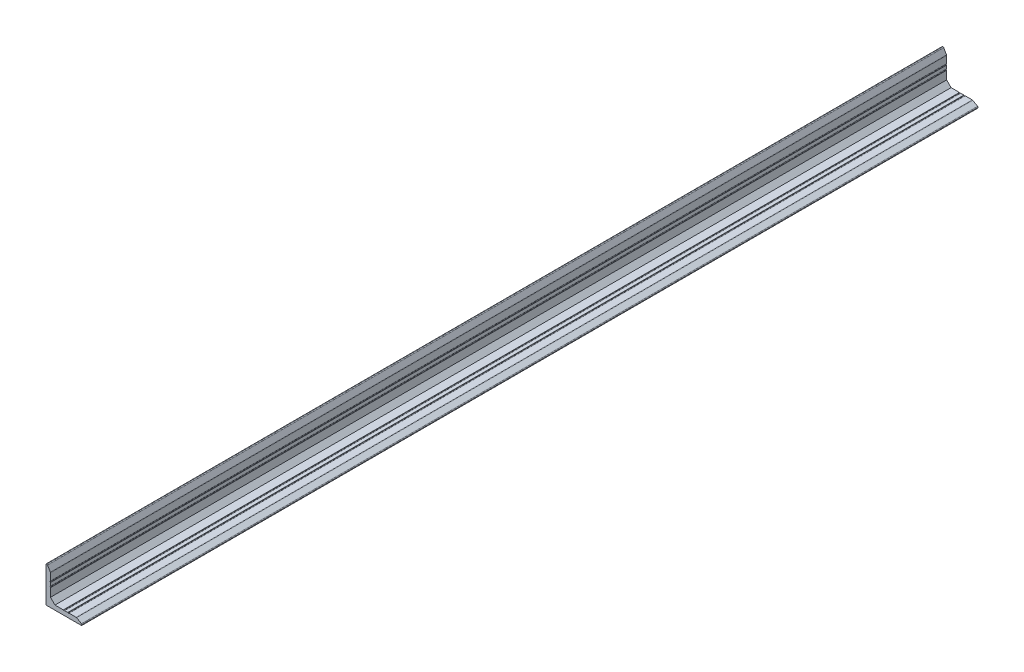
ISO-10303-21;
HEADER;
FILE_DESCRIPTION(('STEP AP214'),'2;1');
FILE_NAME('part.step','',(''),(''),'','','');
FILE_SCHEMA(('AUTOMOTIVE_DESIGN { 1 0 10303 214 1 1 1 1 }'));
ENDSEC;
DATA;
#1=APPLICATION_CONTEXT('core data for automotive mechanical design processes');
#2=APPLICATION_PROTOCOL_DEFINITION('international standard','automotive_design',2000,#1);
#3=PRODUCT_CONTEXT('',#1,'mechanical');
#4=PRODUCT('Part','Part','',(#3));
#5=PRODUCT_RELATED_PRODUCT_CATEGORY('part','',(#4));
#6=PRODUCT_DEFINITION_FORMATION('','',#4);
#7=PRODUCT_DEFINITION_CONTEXT('part definition',#1,'design');
#8=PRODUCT_DEFINITION('design','',#6,#7);
#9=PRODUCT_DEFINITION_SHAPE('','',#8);
#10=(LENGTH_UNIT() NAMED_UNIT(*) SI_UNIT(.MILLI.,.METRE.));
#11=(NAMED_UNIT(*) PLANE_ANGLE_UNIT() SI_UNIT($,.RADIAN.));
#12=(NAMED_UNIT(*) SI_UNIT($,.STERADIAN.) SOLID_ANGLE_UNIT());
#13=UNCERTAINTY_MEASURE_WITH_UNIT(LENGTH_MEASURE(1.E-05),#10,'distance_accuracy_value','');
#14=(GEOMETRIC_REPRESENTATION_CONTEXT(3) GLOBAL_UNCERTAINTY_ASSIGNED_CONTEXT((#13)) GLOBAL_UNIT_ASSIGNED_CONTEXT((#10,
#11,#12)) REPRESENTATION_CONTEXT('',''));
#15=CARTESIAN_POINT('',(0.,0.,0.));
#16=DIRECTION('',(0.,0.,1.));
#17=DIRECTION('',(1.,0.,0.));
#18=AXIS2_PLACEMENT_3D('',#15,#16,#17);
#19=CARTESIAN_POINT('',(40.,5.00000000000001,1000.));
#20=DIRECTION('',(0.,-1.,0.));
#21=DIRECTION('',(1.,0.,0.));
#22=AXIS2_PLACEMENT_3D('',#19,#20,#21);
#23=PLANE('',#22);
#24=DIRECTION('',(-1.,0.,0.));
#25=VECTOR('',#24,1.);
#26=CARTESIAN_POINT('',(40.,5.00000000000001,0.));
#27=LINE('',#26,#25);
#28=CARTESIAN_POINT('',(33.6698729810774,5.00000000000001,0.));
#29=VERTEX_POINT('',#28);
#30=CARTESIAN_POINT('',(25.7416198487096,5.00000000000001,0.));
#31=VERTEX_POINT('',#30);
#32=EDGE_CURVE('E453',#29,#31,#27,.T.);
#33=ORIENTED_EDGE('',*,*,#32,.T.);
#34=DIRECTION('',(0.,0.,1.));
#35=VECTOR('',#34,1.);
#36=CARTESIAN_POINT('',(25.7416198487096,5.00000000000001,1000.));
#37=LINE('',#36,#35);
#38=CARTESIAN_POINT('',(25.7416198487096,5.00000000000001,1000.));
#39=VERTEX_POINT('',#38);
#40=EDGE_CURVE('E10',#31,#39,#37,.T.);
#41=ORIENTED_EDGE('',*,*,#40,.T.);
#42=DIRECTION('',(-1.,0.,0.));
#43=VECTOR('',#42,1.);
#44=CARTESIAN_POINT('',(40.,5.00000000000001,1000.));
#45=LINE('',#44,#43);
#46=CARTESIAN_POINT('',(33.6698729810774,5.00000000000001,1000.));
#47=VERTEX_POINT('',#46);
#48=EDGE_CURVE('E260',#47,#39,#45,.T.);
#49=ORIENTED_EDGE('',*,*,#48,.F.);
#50=DIRECTION('',(0.,0.,1.));
#51=VECTOR('',#50,1.);
#52=CARTESIAN_POINT('',(33.6698729810774,5.00000000000001,0.));
#53=LINE('',#52,#51);
#54=EDGE_CURVE('E333',#47,#29,#53,.F.);
#55=ORIENTED_EDGE('',*,*,#54,.T.);
#56=EDGE_LOOP('',(#33,#41,#49,#55));
#57=FACE_BOUND('',#56,.T.);
#58=ADVANCED_FACE('F16',(#57),#23,.F.);
#59=CARTESIAN_POINT('',(24.2583801512904,5.00000000000001,0.));
#60=VERTEX_POINT('',#59);
#61=CARTESIAN_POINT('',(20.7416198487095,5.,0.));
#62=VERTEX_POINT('',#61);
#63=EDGE_CURVE('E457',#60,#62,#27,.T.);
#64=ORIENTED_EDGE('',*,*,#63,.T.);
#65=DIRECTION('',(0.,0.,1.));
#66=VECTOR('',#65,1.);
#67=CARTESIAN_POINT('',(20.7416198487095,5.,1000.));
#68=LINE('',#67,#66);
#69=CARTESIAN_POINT('',(20.7416198487095,5.,1000.));
#70=VERTEX_POINT('',#69);
#71=EDGE_CURVE('E401',#62,#70,#68,.T.);
#72=ORIENTED_EDGE('',*,*,#71,.T.);
#73=CARTESIAN_POINT('',(24.2583801512904,5.00000000000001,1000.));
#74=VERTEX_POINT('',#73);
#75=EDGE_CURVE('E258',#74,#70,#45,.T.);
#76=ORIENTED_EDGE('',*,*,#75,.F.);
#77=DIRECTION('',(0.,0.,1.));
#78=VECTOR('',#77,1.);
#79=CARTESIAN_POINT('',(24.2583801512904,5.00000000000001,1000.));
#80=LINE('',#79,#78);
#81=EDGE_CURVE('E38',#74,#60,#80,.F.);
#82=ORIENTED_EDGE('',*,*,#81,.T.);
#83=EDGE_LOOP('',(#64,#72,#76,#82));
#84=FACE_BOUND('',#83,.T.);
#85=ADVANCED_FACE('F488',(#84),#23,.F.);
#86=CARTESIAN_POINT('',(5.,5.,1000.));
#87=DIRECTION('',(-1.,0.,0.));
#88=DIRECTION('',(0.,0.,1.));
#89=AXIS2_PLACEMENT_3D('',#86,#87,#88);
#90=PLANE('',#89);
#91=DIRECTION('',(0.,1.,0.));
#92=VECTOR('',#91,1.);
#93=CARTESIAN_POINT('',(5.,5.,1000.));
#94=LINE('',#93,#92);
#95=CARTESIAN_POINT('',(5.,20.7416198487095,1000.));
#96=VERTEX_POINT('',#95);
#97=CARTESIAN_POINT('',(5.,24.2583801512904,1000.));
#98=VERTEX_POINT('',#97);
#99=EDGE_CURVE('E444',#96,#98,#94,.T.);
#100=ORIENTED_EDGE('',*,*,#99,.F.);
#101=DIRECTION('',(0.,0.,1.));
#102=VECTOR('',#101,1.);
#103=CARTESIAN_POINT('',(5.,20.7416198487095,1000.));
#104=LINE('',#103,#102);
#105=CARTESIAN_POINT('',(5.,20.7416198487095,0.));
#106=VERTEX_POINT('',#105);
#107=EDGE_CURVE('E384',#96,#106,#104,.F.);
#108=ORIENTED_EDGE('',*,*,#107,.T.);
#109=DIRECTION('',(0.,1.,0.));
#110=VECTOR('',#109,1.);
#111=CARTESIAN_POINT('',(5.,5.,0.));
#112=LINE('',#111,#110);
#113=CARTESIAN_POINT('',(5.,24.2583801512904,0.));
#114=VERTEX_POINT('',#113);
#115=EDGE_CURVE('E462',#106,#114,#112,.T.);
#116=ORIENTED_EDGE('',*,*,#115,.T.);
#117=DIRECTION('',(0.,0.,1.));
#118=VECTOR('',#117,1.);
#119=CARTESIAN_POINT('',(5.,24.2583801512904,1000.));
#120=LINE('',#119,#118);
#121=EDGE_CURVE('E381',#114,#98,#120,.T.);
#122=ORIENTED_EDGE('',*,*,#121,.T.);
#123=EDGE_LOOP('',(#100,#108,#116,#122));
#124=FACE_BOUND('',#123,.T.);
#125=ADVANCED_FACE('F495',(#124),#90,.F.);
#126=CARTESIAN_POINT('',(5.,10.,0.));
#127=VERTEX_POINT('',#126);
#128=CARTESIAN_POINT('',(5.,19.2583801512904,0.));
#129=VERTEX_POINT('',#128);
#130=EDGE_CURVE('E458',#127,#129,#112,.T.);
#131=ORIENTED_EDGE('',*,*,#130,.T.);
#132=DIRECTION('',(0.,0.,1.));
#133=VECTOR('',#132,1.);
#134=CARTESIAN_POINT('',(5.,19.2583801512904,1000.));
#135=LINE('',#134,#133);
#136=CARTESIAN_POINT('',(5.,19.2583801512904,1000.));
#137=VERTEX_POINT('',#136);
#138=EDGE_CURVE('E342',#129,#137,#135,.T.);
#139=ORIENTED_EDGE('',*,*,#138,.T.);
#140=CARTESIAN_POINT('',(5.,10.,1000.));
#141=VERTEX_POINT('',#140);
#142=EDGE_CURVE('E441',#141,#137,#94,.T.);
#143=ORIENTED_EDGE('',*,*,#142,.F.);
#144=DIRECTION('',(0.,0.,-1.));
#145=VECTOR('',#144,1.);
#146=CARTESIAN_POINT('',(5.,10.,0.));
#147=LINE('',#146,#145);
#148=EDGE_CURVE('E285',#141,#127,#147,.T.);
#149=ORIENTED_EDGE('',*,*,#148,.T.);
#150=EDGE_LOOP('',(#131,#139,#143,#149));
#151=FACE_BOUND('',#150,.T.);
#152=ADVANCED_FACE('F500',(#151),#90,.F.);
#153=CARTESIAN_POINT('',(19.2583801512904,5.,1000.));
#154=VERTEX_POINT('',#153);
#155=CARTESIAN_POINT('',(10.,5.,1000.));
#156=VERTEX_POINT('',#155);
#157=EDGE_CURVE('E255',#154,#156,#45,.T.);
#158=ORIENTED_EDGE('',*,*,#157,.F.);
#159=DIRECTION('',(0.,0.,1.));
#160=VECTOR('',#159,1.);
#161=CARTESIAN_POINT('',(19.2583801512904,5.,1000.));
#162=LINE('',#161,#160);
#163=CARTESIAN_POINT('',(19.2583801512904,5.,0.));
#164=VERTEX_POINT('',#163);
#165=EDGE_CURVE('E398',#154,#164,#162,.F.);
#166=ORIENTED_EDGE('',*,*,#165,.T.);
#167=CARTESIAN_POINT('',(10.,5.,0.));
#168=VERTEX_POINT('',#167);
#169=EDGE_CURVE('E437',#164,#168,#27,.T.);
#170=ORIENTED_EDGE('',*,*,#169,.T.);
#171=DIRECTION('',(0.,0.,1.));
#172=VECTOR('',#171,1.);
#173=CARTESIAN_POINT('',(10.,5.,1000.));
#174=LINE('',#173,#172);
#175=EDGE_CURVE('E288',#168,#156,#174,.T.);
#176=ORIENTED_EDGE('',*,*,#175,.T.);
#177=EDGE_LOOP('',(#158,#166,#170,#176));
#178=FACE_BOUND('',#177,.T.);
#179=ADVANCED_FACE('F491',(#178),#23,.F.);
#180=CARTESIAN_POINT('',(5.,25.7416198487096,1000.));
#181=VERTEX_POINT('',#180);
#182=CARTESIAN_POINT('',(5.,33.6698729810777,1000.));
#183=VERTEX_POINT('',#182);
#184=EDGE_CURVE('E440',#181,#183,#94,.T.);
#185=ORIENTED_EDGE('',*,*,#184,.F.);
#186=DIRECTION('',(0.,0.,1.));
#187=VECTOR('',#186,1.);
#188=CARTESIAN_POINT('',(5.,25.7416198487096,1000.));
#189=LINE('',#188,#187);
#190=CARTESIAN_POINT('',(5.,25.7416198487096,0.));
#191=VERTEX_POINT('',#190);
#192=EDGE_CURVE('E391',#181,#191,#189,.F.);
#193=ORIENTED_EDGE('',*,*,#192,.T.);
#194=CARTESIAN_POINT('',(5.,33.6698729810777,0.));
#195=VERTEX_POINT('',#194);
#196=EDGE_CURVE('E456',#191,#195,#112,.T.);
#197=ORIENTED_EDGE('',*,*,#196,.T.);
#198=DIRECTION('',(0.,0.,-1.));
#199=VECTOR('',#198,1.);
#200=CARTESIAN_POINT('',(5.,33.6698729810777,1000.));
#201=LINE('',#200,#199);
#202=EDGE_CURVE('E330',#195,#183,#201,.F.);
#203=ORIENTED_EDGE('',*,*,#202,.T.);
#204=EDGE_LOOP('',(#185,#193,#197,#203));
#205=FACE_BOUND('',#204,.T.);
#206=ADVANCED_FACE('F499',(#205),#90,.F.);
#207=CARTESIAN_POINT('',(5.,40.,1000.));
#208=DIRECTION('',(0.,-1.,0.));
#209=DIRECTION('',(0.,0.,-1.));
#210=AXIS2_PLACEMENT_3D('',#207,#208,#209);
#211=PLANE('',#210);
#212=DIRECTION('',(-1.,0.,0.));
#213=VECTOR('',#212,1.);
#214=CARTESIAN_POINT('',(5.,40.,1000.));
#215=LINE('',#214,#213);
#216=CARTESIAN_POINT('',(0.922649730810312,40.,1000.));
#217=VERTEX_POINT('',#216);
#218=CARTESIAN_POINT('',(0.499999999999987,40.,1000.));
#219=VERTEX_POINT('',#218);
#220=EDGE_CURVE('E443',#217,#219,#215,.T.);
#221=ORIENTED_EDGE('',*,*,#220,.F.);
#222=DIRECTION('',(0.,0.,1.));
#223=VECTOR('',#222,1.);
#224=CARTESIAN_POINT('',(0.922649730810312,40.,0.));
#225=LINE('',#224,#223);
#226=CARTESIAN_POINT('',(0.922649730810312,40.,0.));
#227=VERTEX_POINT('',#226);
#228=EDGE_CURVE('E307',#217,#227,#225,.F.);
#229=ORIENTED_EDGE('',*,*,#228,.T.);
#230=DIRECTION('',(-1.,0.,0.));
#231=VECTOR('',#230,1.);
#232=CARTESIAN_POINT('',(5.,40.,0.));
#233=LINE('',#232,#231);
#234=CARTESIAN_POINT('',(0.499999999999987,40.,0.));
#235=VERTEX_POINT('',#234);
#236=EDGE_CURVE('E461',#227,#235,#233,.T.);
#237=ORIENTED_EDGE('',*,*,#236,.T.);
#238=DIRECTION('',(0.,0.,-1.));
#239=VECTOR('',#238,1.);
#240=CARTESIAN_POINT('',(0.499999999999987,40.,1000.));
#241=LINE('',#240,#239);
#242=EDGE_CURVE('E282',#235,#219,#241,.F.);
#243=ORIENTED_EDGE('',*,*,#242,.T.);
#244=EDGE_LOOP('',(#221,#229,#237,#243));
#245=FACE_BOUND('',#244,.T.);
#246=ADVANCED_FACE('F485',(#245),#211,.F.);
#247=CARTESIAN_POINT('',(0.,40.,1000.));
#248=DIRECTION('',(1.,0.,0.));
#249=DIRECTION('',(0.,1.,0.));
#250=AXIS2_PLACEMENT_3D('',#247,#248,#249);
#251=PLANE('',#250);
#252=DIRECTION('',(0.,-1.,0.));
#253=VECTOR('',#252,1.);
#254=CARTESIAN_POINT('',(0.,40.,1000.));
#255=LINE('',#254,#253);
#256=CARTESIAN_POINT('',(0.,39.5,1000.));
#257=VERTEX_POINT('',#256);
#258=CARTESIAN_POINT('',(0.,0.5,1000.));
#259=VERTEX_POINT('',#258);
#260=EDGE_CURVE('E446',#257,#259,#255,.T.);
#261=ORIENTED_EDGE('',*,*,#260,.F.);
#262=DIRECTION('',(0.,0.,-1.));
#263=VECTOR('',#262,1.);
#264=CARTESIAN_POINT('',(0.,39.5,1000.));
#265=LINE('',#264,#263);
#266=CARTESIAN_POINT('',(0.,39.5,0.));
#267=VERTEX_POINT('',#266);
#268=EDGE_CURVE('E279',#257,#267,#265,.T.);
#269=ORIENTED_EDGE('',*,*,#268,.T.);
#270=DIRECTION('',(0.,-1.,0.));
#271=VECTOR('',#270,1.);
#272=CARTESIAN_POINT('',(0.,40.,0.));
#273=LINE('',#272,#271);
#274=CARTESIAN_POINT('',(0.,0.5,0.));
#275=VERTEX_POINT('',#274);
#276=EDGE_CURVE('E261',#267,#275,#273,.T.);
#277=ORIENTED_EDGE('',*,*,#276,.T.);
#278=DIRECTION('',(0.,0.,-1.));
#279=VECTOR('',#278,1.);
#280=CARTESIAN_POINT('',(0.,0.5,1000.));
#281=LINE('',#280,#279);
#282=EDGE_CURVE('E277',#275,#259,#281,.F.);
#283=ORIENTED_EDGE('',*,*,#282,.T.);
#284=EDGE_LOOP('',(#261,#269,#277,#283));
#285=FACE_BOUND('',#284,.T.);
#286=ADVANCED_FACE('F468',(#285),#251,.F.);
#287=CARTESIAN_POINT('',(0.,0.,1000.));
#288=DIRECTION('',(0.,1.,0.));
#289=DIRECTION('',(0.,0.,1.));
#290=AXIS2_PLACEMENT_3D('',#287,#288,#289);
#291=PLANE('',#290);
#292=DIRECTION('',(1.,0.,0.));
#293=VECTOR('',#292,1.);
#294=CARTESIAN_POINT('',(0.,0.,0.));
#295=LINE('',#294,#293);
#296=CARTESIAN_POINT('',(0.5,0.,0.));
#297=VERTEX_POINT('',#296);
#298=CARTESIAN_POINT('',(39.5,0.,0.));
#299=VERTEX_POINT('',#298);
#300=EDGE_CURVE('E256',#297,#299,#295,.T.);
#301=ORIENTED_EDGE('',*,*,#300,.T.);
#302=DIRECTION('',(0.,0.,-1.));
#303=VECTOR('',#302,1.);
#304=CARTESIAN_POINT('',(39.5,0.,1000.));
#305=LINE('',#304,#303);
#306=CARTESIAN_POINT('',(39.5,0.,1000.));
#307=VERTEX_POINT('',#306);
#308=EDGE_CURVE('E232',#299,#307,#305,.F.);
#309=ORIENTED_EDGE('',*,*,#308,.T.);
#310=DIRECTION('',(1.,0.,0.));
#311=VECTOR('',#310,1.);
#312=CARTESIAN_POINT('',(0.,0.,1000.));
#313=LINE('',#312,#311);
#314=CARTESIAN_POINT('',(0.5,0.,1000.));
#315=VERTEX_POINT('',#314);
#316=EDGE_CURVE('E449',#315,#307,#313,.T.);
#317=ORIENTED_EDGE('',*,*,#316,.F.);
#318=DIRECTION('',(0.,0.,-1.));
#319=VECTOR('',#318,1.);
#320=CARTESIAN_POINT('',(0.5,0.,1000.));
#321=LINE('',#320,#319);
#322=EDGE_CURVE('E236',#315,#297,#321,.T.);
#323=ORIENTED_EDGE('',*,*,#322,.T.);
#324=EDGE_LOOP('',(#301,#309,#317,#323));
#325=FACE_BOUND('',#324,.T.);
#326=ADVANCED_FACE('F476',(#325),#291,.F.);
#327=CARTESIAN_POINT('',(40.,0.,1000.));
#328=DIRECTION('',(-1.,0.,0.));
#329=DIRECTION('',(0.,0.,1.));
#330=AXIS2_PLACEMENT_3D('',#327,#328,#329);
#331=PLANE('',#330);
#332=DIRECTION('',(0.,1.,0.));
#333=VECTOR('',#332,1.);
#334=CARTESIAN_POINT('',(40.,0.,0.));
#335=LINE('',#334,#333);
#336=CARTESIAN_POINT('',(40.,0.5,0.));
#337=VERTEX_POINT('',#336);
#338=CARTESIAN_POINT('',(40.,0.922649730810212,0.));
#339=VERTEX_POINT('',#338);
#340=EDGE_CURVE('E244',#337,#339,#335,.T.);
#341=ORIENTED_EDGE('',*,*,#340,.T.);
#342=DIRECTION('',(0.,0.,-1.));
#343=VECTOR('',#342,1.);
#344=CARTESIAN_POINT('',(40.,0.922649730810212,1000.));
#345=LINE('',#344,#343);
#346=CARTESIAN_POINT('',(40.,0.922649730810212,1000.));
#347=VERTEX_POINT('',#346);
#348=EDGE_CURVE('E340',#339,#347,#345,.F.);
#349=ORIENTED_EDGE('',*,*,#348,.T.);
#350=DIRECTION('',(0.,1.,0.));
#351=VECTOR('',#350,1.);
#352=CARTESIAN_POINT('',(40.,0.,1000.));
#353=LINE('',#352,#351);
#354=CARTESIAN_POINT('',(40.,0.5,1000.));
#355=VERTEX_POINT('',#354);
#356=EDGE_CURVE('E247',#355,#347,#353,.T.);
#357=ORIENTED_EDGE('',*,*,#356,.F.);
#358=DIRECTION('',(0.,0.,-1.));
#359=VECTOR('',#358,1.);
#360=CARTESIAN_POINT('',(40.,0.5,1000.));
#361=LINE('',#360,#359);
#362=EDGE_CURVE('E231',#355,#337,#361,.T.);
#363=ORIENTED_EDGE('',*,*,#362,.T.);
#364=EDGE_LOOP('',(#341,#349,#357,#363));
#365=FACE_BOUND('',#364,.T.);
#366=ADVANCED_FACE('F242',(#365),#331,.F.);
#367=CARTESIAN_POINT('',(0.,0.,1000.));
#368=DIRECTION('',(0.,0.,-1.));
#369=DIRECTION('',(-1.,0.,0.));
#370=AXIS2_PLACEMENT_3D('',#367,#368,#369);
#371=PLANE('',#370);
#372=ORIENTED_EDGE('',*,*,#142,.T.);
#373=CARTESIAN_POINT('',(4.7,19.2583801512904,1000.));
#374=DIRECTION('',(0.,0.,-1.));
#375=DIRECTION('',(-1.,0.,0.));
#376=AXIS2_PLACEMENT_3D('',#373,#374,#375);
#377=CIRCLE('',#376,0.3);
#378=CARTESIAN_POINT('',(4.8125,19.5364875945565,1000.));
#379=VERTEX_POINT('',#378);
#380=EDGE_CURVE('E359',#137,#379,#377,.F.);
#381=ORIENTED_EDGE('',*,*,#380,.T.);
#382=CARTESIAN_POINT('',(5.,20.,1000.));
#383=DIRECTION('',(0.,0.,1.));
#384=DIRECTION('',(-1.,0.,0.));
#385=AXIS2_PLACEMENT_3D('',#382,#383,#384);
#386=CIRCLE('',#385,0.499999999999999);
#387=CARTESIAN_POINT('',(4.8125,20.4635124054435,1000.));
#388=VERTEX_POINT('',#387);
#389=EDGE_CURVE('E537',#388,#379,#386,.T.);
#390=ORIENTED_EDGE('',*,*,#389,.F.);
#391=CARTESIAN_POINT('',(4.7,20.7416198487095,1000.));
#392=DIRECTION('',(0.,0.,-1.));
#393=DIRECTION('',(-1.,0.,0.));
#394=AXIS2_PLACEMENT_3D('',#391,#392,#393);
#395=CIRCLE('',#394,0.3);
#396=EDGE_CURVE('E357',#388,#96,#395,.F.);
#397=ORIENTED_EDGE('',*,*,#396,.T.);
#398=ORIENTED_EDGE('',*,*,#99,.T.);
#399=CARTESIAN_POINT('',(4.7,24.2583801512904,1000.));
#400=DIRECTION('',(0.,0.,-1.));
#401=DIRECTION('',(-1.,0.,0.));
#402=AXIS2_PLACEMENT_3D('',#399,#400,#401);
#403=CIRCLE('',#402,0.3);
#404=CARTESIAN_POINT('',(4.8125,24.5364875945565,1000.));
#405=VERTEX_POINT('',#404);
#406=EDGE_CURVE('E355',#98,#405,#403,.F.);
#407=ORIENTED_EDGE('',*,*,#406,.T.);
#408=CARTESIAN_POINT('',(5.,25.,1000.));
#409=DIRECTION('',(0.,0.,1.));
#410=DIRECTION('',(-1.,0.,0.));
#411=AXIS2_PLACEMENT_3D('',#408,#409,#410);
#412=CIRCLE('',#411,0.500000000000002);
#413=CARTESIAN_POINT('',(4.8125,25.4635124054435,1000.));
#414=VERTEX_POINT('',#413);
#415=EDGE_CURVE('E428',#414,#405,#412,.T.);
#416=ORIENTED_EDGE('',*,*,#415,.F.);
#417=CARTESIAN_POINT('',(4.7,25.7416198487096,1000.));
#418=DIRECTION('',(0.,0.,-1.));
#419=DIRECTION('',(-1.,0.,0.));
#420=AXIS2_PLACEMENT_3D('',#417,#418,#419);
#421=CIRCLE('',#420,0.3);
#422=EDGE_CURVE('E353',#414,#181,#421,.F.);
#423=ORIENTED_EDGE('',*,*,#422,.T.);
#424=ORIENTED_EDGE('',*,*,#184,.T.);
#425=CARTESIAN_POINT('',(4.,33.6698729810777,1000.));
#426=DIRECTION('',(0.,0.,-1.));
#427=DIRECTION('',(-1.,0.,0.));
#428=AXIS2_PLACEMENT_3D('',#425,#426,#427);
#429=CIRCLE('',#428,1.);
#430=CARTESIAN_POINT('',(4.86602540378444,34.1698729810777,1000.));
#431=VERTEX_POINT('',#430);
#432=EDGE_CURVE('E326',#183,#431,#429,.F.);
#433=ORIENTED_EDGE('',*,*,#432,.T.);
#434=DIRECTION('',(0.499999999999998,-0.86602540378444,0.));
#435=VECTOR('',#434,1.);
#436=CARTESIAN_POINT('',(1.49999999999994,40.,1000.));
#437=LINE('',#436,#435);
#438=CARTESIAN_POINT('',(1.78867513459475,39.5,1000.));
#439=VERTEX_POINT('',#438);
#440=EDGE_CURVE('E304',#431,#439,#437,.F.);
#441=ORIENTED_EDGE('',*,*,#440,.T.);
#442=CARTESIAN_POINT('',(0.922649730810312,39.,1000.));
#443=DIRECTION('',(0.,0.,-1.));
#444=DIRECTION('',(-1.,0.,0.));
#445=AXIS2_PLACEMENT_3D('',#442,#443,#444);
#446=CIRCLE('',#445,1.);
#447=EDGE_CURVE('E328',#439,#217,#446,.F.);
#448=ORIENTED_EDGE('',*,*,#447,.T.);
#449=ORIENTED_EDGE('',*,*,#220,.T.);
#450=CARTESIAN_POINT('',(0.499999999999987,39.5,1000.));
#451=DIRECTION('',(0.,0.,-1.));
#452=DIRECTION('',(-1.,0.,0.));
#453=AXIS2_PLACEMENT_3D('',#450,#451,#452);
#454=CIRCLE('',#453,0.5);
#455=EDGE_CURVE('E273',#219,#257,#454,.F.);
#456=ORIENTED_EDGE('',*,*,#455,.T.);
#457=ORIENTED_EDGE('',*,*,#260,.T.);
#458=CARTESIAN_POINT('',(0.5,0.5,1000.));
#459=DIRECTION('',(0.,0.,-1.));
#460=DIRECTION('',(-1.,0.,0.));
#461=AXIS2_PLACEMENT_3D('',#458,#459,#460);
#462=CIRCLE('',#461,0.5);
#463=EDGE_CURVE('E271',#259,#315,#462,.F.);
#464=ORIENTED_EDGE('',*,*,#463,.T.);
#465=ORIENTED_EDGE('',*,*,#316,.T.);
#466=CARTESIAN_POINT('',(39.5,0.5,1000.));
#467=DIRECTION('',(0.,0.,-1.));
#468=DIRECTION('',(-1.,0.,0.));
#469=AXIS2_PLACEMENT_3D('',#466,#467,#468);
#470=CIRCLE('',#469,0.5);
#471=EDGE_CURVE('E275',#307,#355,#470,.F.);
#472=ORIENTED_EDGE('',*,*,#471,.T.);
#473=ORIENTED_EDGE('',*,*,#356,.T.);
#474=CARTESIAN_POINT('',(39.,0.922649730810212,1000.));
#475=DIRECTION('',(0.,0.,-1.));
#476=DIRECTION('',(-1.,0.,0.));
#477=AXIS2_PLACEMENT_3D('',#474,#475,#476);
#478=CIRCLE('',#477,1.);
#479=CARTESIAN_POINT('',(39.5,1.78867513459465,1000.));
#480=VERTEX_POINT('',#479);
#481=EDGE_CURVE('E322',#347,#480,#478,.F.);
#482=ORIENTED_EDGE('',*,*,#481,.T.);
#483=DIRECTION('',(0.866025403784441,-0.499999999999996,0.));
#484=VECTOR('',#483,1.);
#485=CARTESIAN_POINT('',(33.9378221735086,5.00000000000001,1000.));
#486=LINE('',#485,#484);
#487=CARTESIAN_POINT('',(34.1698729810774,4.86602540378445,1000.));
#488=VERTEX_POINT('',#487);
#489=EDGE_CURVE('E301',#480,#488,#486,.F.);
#490=ORIENTED_EDGE('',*,*,#489,.T.);
#491=CARTESIAN_POINT('',(33.6698729810774,4.00000000000001,1000.));
#492=DIRECTION('',(0.,0.,-1.));
#493=DIRECTION('',(-1.,0.,0.));
#494=AXIS2_PLACEMENT_3D('',#491,#492,#493);
#495=CIRCLE('',#494,1.);
#496=EDGE_CURVE('E324',#488,#47,#495,.F.);
#497=ORIENTED_EDGE('',*,*,#496,.T.);
#498=ORIENTED_EDGE('',*,*,#48,.T.);
#499=CARTESIAN_POINT('',(25.7416198487096,4.70000000000001,1000.));
#500=DIRECTION('',(0.,0.,-1.));
#501=DIRECTION('',(-1.,0.,0.));
#502=AXIS2_PLACEMENT_3D('',#499,#500,#501);
#503=CIRCLE('',#502,0.3);
#504=CARTESIAN_POINT('',(25.4635124054435,4.81250000000001,1000.));
#505=VERTEX_POINT('',#504);
#506=EDGE_CURVE('E345',#39,#505,#503,.F.);
#507=ORIENTED_EDGE('',*,*,#506,.T.);
#508=CARTESIAN_POINT('',(25.,5.00000000000001,1000.));
#509=DIRECTION('',(0.,0.,1.));
#510=DIRECTION('',(1.,0.,0.));
#511=AXIS2_PLACEMENT_3D('',#508,#509,#510);
#512=CIRCLE('',#511,0.5);
#513=CARTESIAN_POINT('',(24.5364875945565,4.81250000000001,1000.));
#514=VERTEX_POINT('',#513);
#515=EDGE_CURVE('E412',#514,#505,#512,.T.);
#516=ORIENTED_EDGE('',*,*,#515,.F.);
#517=CARTESIAN_POINT('',(24.2583801512904,4.70000000000001,1000.));
#518=DIRECTION('',(0.,0.,-1.));
#519=DIRECTION('',(-1.,0.,0.));
#520=AXIS2_PLACEMENT_3D('',#517,#518,#519);
#521=CIRCLE('',#520,0.3);
#522=EDGE_CURVE('E347',#514,#74,#521,.F.);
#523=ORIENTED_EDGE('',*,*,#522,.T.);
#524=ORIENTED_EDGE('',*,*,#75,.T.);
#525=CARTESIAN_POINT('',(20.7416198487095,4.7,1000.));
#526=DIRECTION('',(0.,0.,-1.));
#527=DIRECTION('',(-1.,0.,0.));
#528=AXIS2_PLACEMENT_3D('',#525,#526,#527);
#529=CIRCLE('',#528,0.3);
#530=CARTESIAN_POINT('',(20.4635124054435,4.81250000000001,1000.));
#531=VERTEX_POINT('',#530);
#532=EDGE_CURVE('E349',#70,#531,#529,.F.);
#533=ORIENTED_EDGE('',*,*,#532,.T.);
#534=CARTESIAN_POINT('',(20.,5.00000000000001,1000.));
#535=DIRECTION('',(0.,0.,1.));
#536=DIRECTION('',(1.,0.,0.));
#537=AXIS2_PLACEMENT_3D('',#534,#535,#536);
#538=CIRCLE('',#537,0.5);
#539=CARTESIAN_POINT('',(19.5364875945565,4.81250000000001,1000.));
#540=VERTEX_POINT('',#539);
#541=EDGE_CURVE('E425',#540,#531,#538,.T.);
#542=ORIENTED_EDGE('',*,*,#541,.F.);
#543=CARTESIAN_POINT('',(19.2583801512904,4.7,1000.));
#544=DIRECTION('',(0.,0.,-1.));
#545=DIRECTION('',(-1.,0.,0.));
#546=AXIS2_PLACEMENT_3D('',#543,#544,#545);
#547=CIRCLE('',#546,0.3);
#548=EDGE_CURVE('E351',#540,#154,#547,.F.);
#549=ORIENTED_EDGE('',*,*,#548,.T.);
#550=ORIENTED_EDGE('',*,*,#157,.T.);
#551=DIRECTION('',(0.707106781186547,-0.707106781186548,0.));
#552=VECTOR('',#551,1.);
#553=CARTESIAN_POINT('',(7.5,7.5,1000.));
#554=LINE('',#553,#552);
#555=EDGE_CURVE('E294',#156,#141,#554,.F.);
#556=ORIENTED_EDGE('',*,*,#555,.T.);
#557=EDGE_LOOP('',(#372,#381,#390,#397,#398,#407,#416,#423,#424,#433,#441,#448,#449,#456,#457,
#464,#465,#472,#473,#482,#490,#497,#498,#507,#516,#523,#524,#533,#542,#549,#550,#556));
#558=FACE_BOUND('',#557,.T.);
#559=ADVANCED_FACE('F420',(#558),#371,.F.);
#560=CARTESIAN_POINT('',(0.,0.,0.));
#561=DIRECTION('',(0.,0.,-1.));
#562=DIRECTION('',(-1.,0.,0.));
#563=AXIS2_PLACEMENT_3D('',#560,#561,#562);
#564=PLANE('',#563);
#565=CARTESIAN_POINT('',(5.,20.,0.));
#566=DIRECTION('',(0.,0.,1.));
#567=DIRECTION('',(-1.,0.,0.));
#568=AXIS2_PLACEMENT_3D('',#565,#566,#567);
#569=CIRCLE('',#568,0.499999999999999);
#570=CARTESIAN_POINT('',(4.8125,20.4635124054435,0.));
#571=VERTEX_POINT('',#570);
#572=CARTESIAN_POINT('',(4.8125,19.5364875945565,0.));
#573=VERTEX_POINT('',#572);
#574=EDGE_CURVE('E434',#571,#573,#569,.T.);
#575=ORIENTED_EDGE('',*,*,#574,.T.);
#576=CARTESIAN_POINT('',(4.7,19.2583801512904,0.));
#577=DIRECTION('',(0.,0.,-1.));
#578=DIRECTION('',(-1.,0.,0.));
#579=AXIS2_PLACEMENT_3D('',#576,#577,#578);
#580=CIRCLE('',#579,0.3);
#581=EDGE_CURVE('E379',#573,#129,#580,.T.);
#582=ORIENTED_EDGE('',*,*,#581,.T.);
#583=ORIENTED_EDGE('',*,*,#130,.F.);
#584=DIRECTION('',(-0.707106781186547,0.707106781186548,0.));
#585=VECTOR('',#584,1.);
#586=CARTESIAN_POINT('',(5.,10.,0.));
#587=LINE('',#586,#585);
#588=EDGE_CURVE('E291',#127,#168,#587,.F.);
#589=ORIENTED_EDGE('',*,*,#588,.T.);
#590=ORIENTED_EDGE('',*,*,#169,.F.);
#591=CARTESIAN_POINT('',(19.2583801512904,4.7,0.));
#592=DIRECTION('',(0.,0.,-1.));
#593=DIRECTION('',(-1.,0.,0.));
#594=AXIS2_PLACEMENT_3D('',#591,#592,#593);
#595=CIRCLE('',#594,0.3);
#596=CARTESIAN_POINT('',(19.5364875945565,4.81250000000001,0.));
#597=VERTEX_POINT('',#596);
#598=EDGE_CURVE('E371',#164,#597,#595,.T.);
#599=ORIENTED_EDGE('',*,*,#598,.T.);
#600=CARTESIAN_POINT('',(20.,5.00000000000001,0.));
#601=DIRECTION('',(0.,0.,1.));
#602=DIRECTION('',(1.,0.,0.));
#603=AXIS2_PLACEMENT_3D('',#600,#601,#602);
#604=CIRCLE('',#603,0.5);
#605=CARTESIAN_POINT('',(20.4635124054435,4.81250000000001,0.));
#606=VERTEX_POINT('',#605);
#607=EDGE_CURVE('E435',#597,#606,#604,.T.);
#608=ORIENTED_EDGE('',*,*,#607,.T.);
#609=CARTESIAN_POINT('',(20.7416198487095,4.7,0.));
#610=DIRECTION('',(0.,0.,-1.));
#611=DIRECTION('',(-1.,0.,0.));
#612=AXIS2_PLACEMENT_3D('',#609,#610,#611);
#613=CIRCLE('',#612,0.3);
#614=EDGE_CURVE('E31',#606,#62,#613,.T.);
#615=ORIENTED_EDGE('',*,*,#614,.T.);
#616=ORIENTED_EDGE('',*,*,#63,.F.);
#617=CARTESIAN_POINT('',(24.2583801512904,4.70000000000001,0.));
#618=DIRECTION('',(0.,0.,-1.));
#619=DIRECTION('',(-1.,0.,0.));
#620=AXIS2_PLACEMENT_3D('',#617,#618,#619);
#621=CIRCLE('',#620,0.3);
#622=CARTESIAN_POINT('',(24.5364875945565,4.81250000000001,0.));
#623=VERTEX_POINT('',#622);
#624=EDGE_CURVE('E368',#60,#623,#621,.T.);
#625=ORIENTED_EDGE('',*,*,#624,.T.);
#626=CARTESIAN_POINT('',(25.,5.00000000000001,0.));
#627=DIRECTION('',(0.,0.,1.));
#628=DIRECTION('',(1.,0.,0.));
#629=AXIS2_PLACEMENT_3D('',#626,#627,#628);
#630=CIRCLE('',#629,0.5);
#631=CARTESIAN_POINT('',(25.4635124054435,4.81250000000001,0.));
#632=VERTEX_POINT('',#631);
#633=EDGE_CURVE('E415',#623,#632,#630,.T.);
#634=ORIENTED_EDGE('',*,*,#633,.T.);
#635=CARTESIAN_POINT('',(25.7416198487096,4.70000000000001,0.));
#636=DIRECTION('',(0.,0.,-1.));
#637=DIRECTION('',(-1.,0.,0.));
#638=AXIS2_PLACEMENT_3D('',#635,#636,#637);
#639=CIRCLE('',#638,0.3);
#640=EDGE_CURVE('E366',#632,#31,#639,.T.);
#641=ORIENTED_EDGE('',*,*,#640,.T.);
#642=ORIENTED_EDGE('',*,*,#32,.F.);
#643=CARTESIAN_POINT('',(33.6698729810774,4.00000000000001,0.));
#644=DIRECTION('',(0.,0.,-1.));
#645=DIRECTION('',(-1.,0.,0.));
#646=AXIS2_PLACEMENT_3D('',#643,#644,#645);
#647=CIRCLE('',#646,1.);
#648=CARTESIAN_POINT('',(34.1698729810774,4.86602540378445,0.));
#649=VERTEX_POINT('',#648);
#650=EDGE_CURVE('E311',#29,#649,#647,.T.);
#651=ORIENTED_EDGE('',*,*,#650,.T.);
#652=DIRECTION('',(-0.866025403784441,0.499999999999996,0.));
#653=VECTOR('',#652,1.);
#654=CARTESIAN_POINT('',(10.6495190528381,18.4455080756886,0.));
#655=LINE('',#654,#653);
#656=CARTESIAN_POINT('',(39.5,1.78867513459465,0.));
#657=VERTEX_POINT('',#656);
#658=EDGE_CURVE('E296',#649,#657,#655,.F.);
#659=ORIENTED_EDGE('',*,*,#658,.T.);
#660=CARTESIAN_POINT('',(39.,0.922649730810212,0.));
#661=DIRECTION('',(0.,0.,-1.));
#662=DIRECTION('',(-1.,0.,0.));
#663=AXIS2_PLACEMENT_3D('',#660,#661,#662);
#664=CIRCLE('',#663,1.);
#665=EDGE_CURVE('E254',#657,#339,#664,.T.);
#666=ORIENTED_EDGE('',*,*,#665,.T.);
#667=ORIENTED_EDGE('',*,*,#340,.F.);
#668=CARTESIAN_POINT('',(39.5,0.5,0.));
#669=DIRECTION('',(0.,0.,-1.));
#670=DIRECTION('',(-1.,0.,0.));
#671=AXIS2_PLACEMENT_3D('',#668,#669,#670);
#672=CIRCLE('',#671,0.5);
#673=EDGE_CURVE('E227',#337,#299,#672,.T.);
#674=ORIENTED_EDGE('',*,*,#673,.T.);
#675=ORIENTED_EDGE('',*,*,#300,.F.);
#676=CARTESIAN_POINT('',(0.5,0.5,0.));
#677=DIRECTION('',(0.,0.,-1.));
#678=DIRECTION('',(-1.,0.,0.));
#679=AXIS2_PLACEMENT_3D('',#676,#677,#678);
#680=CIRCLE('',#679,0.5);
#681=EDGE_CURVE('E248',#297,#275,#680,.T.);
#682=ORIENTED_EDGE('',*,*,#681,.T.);
#683=ORIENTED_EDGE('',*,*,#276,.F.);
#684=CARTESIAN_POINT('',(0.499999999999987,39.5,0.));
#685=DIRECTION('',(0.,0.,-1.));
#686=DIRECTION('',(-1.,0.,0.));
#687=AXIS2_PLACEMENT_3D('',#684,#685,#686);
#688=CIRCLE('',#687,0.5);
#689=EDGE_CURVE('E237',#267,#235,#688,.T.);
#690=ORIENTED_EDGE('',*,*,#689,.T.);
#691=ORIENTED_EDGE('',*,*,#236,.F.);
#692=CARTESIAN_POINT('',(0.922649730810312,39.,0.));
#693=DIRECTION('',(0.,0.,-1.));
#694=DIRECTION('',(-1.,0.,0.));
#695=AXIS2_PLACEMENT_3D('',#692,#693,#694);
#696=CIRCLE('',#695,1.);
#697=CARTESIAN_POINT('',(1.78867513459475,39.5,0.));
#698=VERTEX_POINT('',#697);
#699=EDGE_CURVE('E316',#227,#698,#696,.T.);
#700=ORIENTED_EDGE('',*,*,#699,.T.);
#701=DIRECTION('',(-0.499999999999998,0.86602540378444,0.));
#702=VECTOR('',#701,1.);
#703=CARTESIAN_POINT('',(18.4455080756887,10.6495190528382,0.));
#704=LINE('',#703,#702);
#705=CARTESIAN_POINT('',(4.86602540378444,34.1698729810777,0.));
#706=VERTEX_POINT('',#705);
#707=EDGE_CURVE('E298',#698,#706,#704,.F.);
#708=ORIENTED_EDGE('',*,*,#707,.T.);
#709=CARTESIAN_POINT('',(4.,33.6698729810777,0.));
#710=DIRECTION('',(0.,0.,-1.));
#711=DIRECTION('',(-1.,0.,0.));
#712=AXIS2_PLACEMENT_3D('',#709,#710,#711);
#713=CIRCLE('',#712,1.);
#714=EDGE_CURVE('E313',#706,#195,#713,.T.);
#715=ORIENTED_EDGE('',*,*,#714,.T.);
#716=ORIENTED_EDGE('',*,*,#196,.F.);
#717=CARTESIAN_POINT('',(4.7,25.7416198487096,0.));
#718=DIRECTION('',(0.,0.,-1.));
#719=DIRECTION('',(-1.,0.,0.));
#720=AXIS2_PLACEMENT_3D('',#717,#718,#719);
#721=CIRCLE('',#720,0.3);
#722=CARTESIAN_POINT('',(4.8125,25.4635124054435,0.));
#723=VERTEX_POINT('',#722);
#724=EDGE_CURVE('E373',#191,#723,#721,.T.);
#725=ORIENTED_EDGE('',*,*,#724,.T.);
#726=CARTESIAN_POINT('',(5.,25.,0.));
#727=DIRECTION('',(0.,0.,1.));
#728=DIRECTION('',(-1.,0.,0.));
#729=AXIS2_PLACEMENT_3D('',#726,#727,#728);
#730=CIRCLE('',#729,0.500000000000002);
#731=CARTESIAN_POINT('',(4.8125,24.5364875945565,0.));
#732=VERTEX_POINT('',#731);
#733=EDGE_CURVE('E423',#723,#732,#730,.T.);
#734=ORIENTED_EDGE('',*,*,#733,.T.);
#735=CARTESIAN_POINT('',(4.7,24.2583801512904,0.));
#736=DIRECTION('',(0.,0.,-1.));
#737=DIRECTION('',(-1.,0.,0.));
#738=AXIS2_PLACEMENT_3D('',#735,#736,#737);
#739=CIRCLE('',#738,0.3);
#740=EDGE_CURVE('E375',#732,#114,#739,.T.);
#741=ORIENTED_EDGE('',*,*,#740,.T.);
#742=ORIENTED_EDGE('',*,*,#115,.F.);
#743=CARTESIAN_POINT('',(4.7,20.7416198487095,0.));
#744=DIRECTION('',(0.,0.,-1.));
#745=DIRECTION('',(-1.,0.,0.));
#746=AXIS2_PLACEMENT_3D('',#743,#744,#745);
#747=CIRCLE('',#746,0.3);
#748=EDGE_CURVE('E377',#106,#571,#747,.T.);
#749=ORIENTED_EDGE('',*,*,#748,.T.);
#750=EDGE_LOOP('',(#575,#582,#583,#589,#590,#599,#608,#615,#616,#625,#634,#641,#642,#651,#659,
#666,#667,#674,#675,#682,#683,#690,#691,#700,#708,#715,#716,#725,#734,#741,#742,#749));
#751=FACE_BOUND('',#750,.T.);
#752=ADVANCED_FACE('F251',(#751),#564,.T.);
#753=CARTESIAN_POINT('',(39.5,0.5,1000.));
#754=DIRECTION('',(0.,0.,-1.));
#755=DIRECTION('',(-1.,0.,0.));
#756=AXIS2_PLACEMENT_3D('',#753,#754,#755);
#757=CYLINDRICAL_SURFACE('',#756,0.5);
#758=ORIENTED_EDGE('',*,*,#471,.F.);
#759=ORIENTED_EDGE('',*,*,#308,.F.);
#760=ORIENTED_EDGE('',*,*,#673,.F.);
#761=ORIENTED_EDGE('',*,*,#362,.F.);
#762=EDGE_LOOP('',(#758,#759,#760,#761));
#763=FACE_BOUND('',#762,.T.);
#764=ADVANCED_FACE('F230',(#763),#757,.T.);
#765=CARTESIAN_POINT('',(0.499999999999987,39.5,1000.));
#766=DIRECTION('',(0.,0.,-1.));
#767=DIRECTION('',(-1.,0.,0.));
#768=AXIS2_PLACEMENT_3D('',#765,#766,#767);
#769=CYLINDRICAL_SURFACE('',#768,0.5);
#770=ORIENTED_EDGE('',*,*,#455,.F.);
#771=ORIENTED_EDGE('',*,*,#242,.F.);
#772=ORIENTED_EDGE('',*,*,#689,.F.);
#773=ORIENTED_EDGE('',*,*,#268,.F.);
#774=EDGE_LOOP('',(#770,#771,#772,#773));
#775=FACE_BOUND('',#774,.T.);
#776=ADVANCED_FACE('F579',(#775),#769,.T.);
#777=CARTESIAN_POINT('',(0.5,0.5,1000.));
#778=DIRECTION('',(0.,0.,-1.));
#779=DIRECTION('',(-1.,0.,0.));
#780=AXIS2_PLACEMENT_3D('',#777,#778,#779);
#781=CYLINDRICAL_SURFACE('',#780,0.5);
#782=ORIENTED_EDGE('',*,*,#463,.F.);
#783=ORIENTED_EDGE('',*,*,#282,.F.);
#784=ORIENTED_EDGE('',*,*,#681,.F.);
#785=ORIENTED_EDGE('',*,*,#322,.F.);
#786=EDGE_LOOP('',(#782,#783,#784,#785));
#787=FACE_BOUND('',#786,.T.);
#788=ADVANCED_FACE('F472',(#787),#781,.T.);
#789=CARTESIAN_POINT('',(5.,10.,1000.));
#790=DIRECTION('',(0.707106781186548,0.707106781186547,0.));
#791=DIRECTION('',(0.,0.,1.));
#792=AXIS2_PLACEMENT_3D('',#789,#790,#791);
#793=PLANE('',#792);
#794=ORIENTED_EDGE('',*,*,#555,.F.);
#795=ORIENTED_EDGE('',*,*,#175,.F.);
#796=ORIENTED_EDGE('',*,*,#588,.F.);
#797=ORIENTED_EDGE('',*,*,#148,.F.);
#798=EDGE_LOOP('',(#794,#795,#796,#797));
#799=FACE_BOUND('',#798,.T.);
#800=ADVANCED_FACE('F528',(#799),#793,.T.);
#801=CARTESIAN_POINT('',(1.49999999999994,40.,1000.));
#802=DIRECTION('',(-0.86602540378444,-0.499999999999998,0.));
#803=DIRECTION('',(0.,0.,-1.));
#804=AXIS2_PLACEMENT_3D('',#801,#802,#803);
#805=PLANE('',#804);
#806=ORIENTED_EDGE('',*,*,#707,.F.);
#807=DIRECTION('',(0.,0.,-1.));
#808=VECTOR('',#807,1.);
#809=CARTESIAN_POINT('',(1.78867513459475,39.5,1000.));
#810=LINE('',#809,#808);
#811=EDGE_CURVE('E320',#698,#439,#810,.F.);
#812=ORIENTED_EDGE('',*,*,#811,.T.);
#813=ORIENTED_EDGE('',*,*,#440,.F.);
#814=DIRECTION('',(0.,0.,1.));
#815=VECTOR('',#814,1.);
#816=CARTESIAN_POINT('',(4.86602540378444,34.1698729810777,0.));
#817=LINE('',#816,#815);
#818=EDGE_CURVE('E318',#431,#706,#817,.F.);
#819=ORIENTED_EDGE('',*,*,#818,.T.);
#820=EDGE_LOOP('',(#806,#812,#813,#819));
#821=FACE_BOUND('',#820,.T.);
#822=ADVANCED_FACE('F569',(#821),#805,.F.);
#823=CARTESIAN_POINT('',(33.9378221735086,5.00000000000001,1000.));
#824=DIRECTION('',(-0.499999999999996,-0.866025403784441,0.));
#825=DIRECTION('',(0.,0.,-1.));
#826=AXIS2_PLACEMENT_3D('',#823,#824,#825);
#827=PLANE('',#826);
#828=ORIENTED_EDGE('',*,*,#658,.F.);
#829=DIRECTION('',(0.,0.,-1.));
#830=VECTOR('',#829,1.);
#831=CARTESIAN_POINT('',(34.1698729810774,4.86602540378445,1000.));
#832=LINE('',#831,#830);
#833=EDGE_CURVE('E338',#649,#488,#832,.F.);
#834=ORIENTED_EDGE('',*,*,#833,.T.);
#835=ORIENTED_EDGE('',*,*,#489,.F.);
#836=DIRECTION('',(0.,0.,1.));
#837=VECTOR('',#836,1.);
#838=CARTESIAN_POINT('',(39.5,1.78867513459465,0.));
#839=LINE('',#838,#837);
#840=EDGE_CURVE('E336',#480,#657,#839,.F.);
#841=ORIENTED_EDGE('',*,*,#840,.T.);
#842=EDGE_LOOP('',(#828,#834,#835,#841));
#843=FACE_BOUND('',#842,.T.);
#844=ADVANCED_FACE('F600',(#843),#827,.F.);
#845=CARTESIAN_POINT('',(0.922649730810312,39.,1000.));
#846=DIRECTION('',(0.,0.,-1.));
#847=DIRECTION('',(-1.,0.,0.));
#848=AXIS2_PLACEMENT_3D('',#845,#846,#847);
#849=CYLINDRICAL_SURFACE('',#848,1.);
#850=ORIENTED_EDGE('',*,*,#447,.F.);
#851=ORIENTED_EDGE('',*,*,#811,.F.);
#852=ORIENTED_EDGE('',*,*,#699,.F.);
#853=ORIENTED_EDGE('',*,*,#228,.F.);
#854=EDGE_LOOP('',(#850,#851,#852,#853));
#855=FACE_BOUND('',#854,.T.);
#856=ADVANCED_FACE('F572',(#855),#849,.T.);
#857=CARTESIAN_POINT('',(4.,33.6698729810777,1000.));
#858=DIRECTION('',(0.,0.,1.));
#859=DIRECTION('',(1.,0.,0.));
#860=AXIS2_PLACEMENT_3D('',#857,#858,#859);
#861=CYLINDRICAL_SURFACE('',#860,1.);
#862=ORIENTED_EDGE('',*,*,#714,.F.);
#863=ORIENTED_EDGE('',*,*,#818,.F.);
#864=ORIENTED_EDGE('',*,*,#432,.F.);
#865=ORIENTED_EDGE('',*,*,#202,.F.);
#866=EDGE_LOOP('',(#862,#863,#864,#865));
#867=FACE_BOUND('',#866,.T.);
#868=ADVANCED_FACE('F562',(#867),#861,.T.);
#869=CARTESIAN_POINT('',(33.6698729810774,4.00000000000001,1000.));
#870=DIRECTION('',(0.,0.,-1.));
#871=DIRECTION('',(-1.,0.,0.));
#872=AXIS2_PLACEMENT_3D('',#869,#870,#871);
#873=CYLINDRICAL_SURFACE('',#872,1.);
#874=ORIENTED_EDGE('',*,*,#496,.F.);
#875=ORIENTED_EDGE('',*,*,#833,.F.);
#876=ORIENTED_EDGE('',*,*,#650,.F.);
#877=ORIENTED_EDGE('',*,*,#54,.F.);
#878=EDGE_LOOP('',(#874,#875,#876,#877));
#879=FACE_BOUND('',#878,.T.);
#880=ADVANCED_FACE('F610',(#879),#873,.T.);
#881=CARTESIAN_POINT('',(39.,0.922649730810212,1000.));
#882=DIRECTION('',(0.,0.,1.));
#883=DIRECTION('',(1.,0.,0.));
#884=AXIS2_PLACEMENT_3D('',#881,#882,#883);
#885=CYLINDRICAL_SURFACE('',#884,1.);
#886=ORIENTED_EDGE('',*,*,#665,.F.);
#887=ORIENTED_EDGE('',*,*,#840,.F.);
#888=ORIENTED_EDGE('',*,*,#481,.F.);
#889=ORIENTED_EDGE('',*,*,#348,.F.);
#890=EDGE_LOOP('',(#886,#887,#888,#889));
#891=FACE_BOUND('',#890,.T.);
#892=ADVANCED_FACE('F613',(#891),#885,.T.);
#893=CARTESIAN_POINT('',(20.,5.00000000000001,0.));
#894=DIRECTION('',(0.,0.,1.));
#895=DIRECTION('',(1.,0.,0.));
#896=AXIS2_PLACEMENT_3D('',#893,#894,#895);
#897=CYLINDRICAL_SURFACE('',#896,0.5);
#898=ORIENTED_EDGE('',*,*,#607,.F.);
#899=DIRECTION('',(0.,0.,1.));
#900=VECTOR('',#899,1.);
#901=CARTESIAN_POINT('',(19.5364875945565,4.81250000000001,0.));
#902=LINE('',#901,#900);
#903=EDGE_CURVE('E395',#597,#540,#902,.T.);
#904=ORIENTED_EDGE('',*,*,#903,.T.);
#905=ORIENTED_EDGE('',*,*,#541,.T.);
#906=DIRECTION('',(0.,0.,1.));
#907=VECTOR('',#906,1.);
#908=CARTESIAN_POINT('',(20.4635124054435,4.81250000000001,0.));
#909=LINE('',#908,#907);
#910=EDGE_CURVE('E393',#531,#606,#909,.F.);
#911=ORIENTED_EDGE('',*,*,#910,.T.);
#912=EDGE_LOOP('',(#898,#904,#905,#911));
#913=FACE_BOUND('',#912,.T.);
#914=ADVANCED_FACE('F519',(#913),#897,.F.);
#915=CARTESIAN_POINT('',(5.,20.,0.));
#916=DIRECTION('',(0.,0.,1.));
#917=DIRECTION('',(1.,0.,0.));
#918=AXIS2_PLACEMENT_3D('',#915,#916,#917);
#919=CYLINDRICAL_SURFACE('',#918,0.499999999999999);
#920=ORIENTED_EDGE('',*,*,#389,.T.);
#921=DIRECTION('',(0.,0.,1.));
#922=VECTOR('',#921,1.);
#923=CARTESIAN_POINT('',(4.8125,19.5364875945565,0.));
#924=LINE('',#923,#922);
#925=EDGE_CURVE('E364',#379,#573,#924,.F.);
#926=ORIENTED_EDGE('',*,*,#925,.T.);
#927=ORIENTED_EDGE('',*,*,#574,.F.);
#928=DIRECTION('',(0.,0.,1.));
#929=VECTOR('',#928,1.);
#930=CARTESIAN_POINT('',(4.8125,20.4635124054435,0.));
#931=LINE('',#930,#929);
#932=EDGE_CURVE('E361',#571,#388,#931,.T.);
#933=ORIENTED_EDGE('',*,*,#932,.T.);
#934=EDGE_LOOP('',(#920,#926,#927,#933));
#935=FACE_BOUND('',#934,.T.);
#936=ADVANCED_FACE('F539',(#935),#919,.F.);
#937=CARTESIAN_POINT('',(5.,25.,0.));
#938=DIRECTION('',(0.,0.,1.));
#939=DIRECTION('',(1.,0.,0.));
#940=AXIS2_PLACEMENT_3D('',#937,#938,#939);
#941=CYLINDRICAL_SURFACE('',#940,0.500000000000002);
#942=ORIENTED_EDGE('',*,*,#415,.T.);
#943=DIRECTION('',(0.,0.,1.));
#944=VECTOR('',#943,1.);
#945=CARTESIAN_POINT('',(4.8125,24.5364875945565,0.));
#946=LINE('',#945,#944);
#947=EDGE_CURVE('E389',#405,#732,#946,.F.);
#948=ORIENTED_EDGE('',*,*,#947,.T.);
#949=ORIENTED_EDGE('',*,*,#733,.F.);
#950=DIRECTION('',(0.,0.,1.));
#951=VECTOR('',#950,1.);
#952=CARTESIAN_POINT('',(4.8125,25.4635124054435,0.));
#953=LINE('',#952,#951);
#954=EDGE_CURVE('E386',#723,#414,#953,.T.);
#955=ORIENTED_EDGE('',*,*,#954,.T.);
#956=EDGE_LOOP('',(#942,#948,#949,#955));
#957=FACE_BOUND('',#956,.T.);
#958=ADVANCED_FACE('F708',(#957),#941,.F.);
#959=CARTESIAN_POINT('',(25.,5.00000000000001,0.));
#960=DIRECTION('',(0.,0.,1.));
#961=DIRECTION('',(1.,0.,0.));
#962=AXIS2_PLACEMENT_3D('',#959,#960,#961);
#963=CYLINDRICAL_SURFACE('',#962,0.5);
#964=ORIENTED_EDGE('',*,*,#633,.F.);
#965=DIRECTION('',(0.,0.,1.));
#966=VECTOR('',#965,1.);
#967=CARTESIAN_POINT('',(24.5364875945565,4.81250000000001,0.));
#968=LINE('',#967,#966);
#969=EDGE_CURVE('E24',#623,#514,#968,.T.);
#970=ORIENTED_EDGE('',*,*,#969,.T.);
#971=ORIENTED_EDGE('',*,*,#515,.T.);
#972=DIRECTION('',(0.,0.,1.));
#973=VECTOR('',#972,1.);
#974=CARTESIAN_POINT('',(25.4635124054435,4.81250000000001,0.));
#975=LINE('',#974,#973);
#976=EDGE_CURVE('E404',#505,#632,#975,.F.);
#977=ORIENTED_EDGE('',*,*,#976,.T.);
#978=EDGE_LOOP('',(#964,#970,#971,#977));
#979=FACE_BOUND('',#978,.T.);
#980=ADVANCED_FACE('F411',(#979),#963,.F.);
#981=CARTESIAN_POINT('',(4.7,19.2583801512904,0.));
#982=DIRECTION('',(0.,0.,1.));
#983=DIRECTION('',(1.,0.,0.));
#984=AXIS2_PLACEMENT_3D('',#981,#982,#983);
#985=CYLINDRICAL_SURFACE('',#984,0.3);
#986=ORIENTED_EDGE('',*,*,#581,.F.);
#987=ORIENTED_EDGE('',*,*,#925,.F.);
#988=ORIENTED_EDGE('',*,*,#380,.F.);
#989=ORIENTED_EDGE('',*,*,#138,.F.);
#990=EDGE_LOOP('',(#986,#987,#988,#989));
#991=FACE_BOUND('',#990,.T.);
#992=ADVANCED_FACE('F533',(#991),#985,.T.);
#993=CARTESIAN_POINT('',(4.7,20.7416198487095,0.));
#994=DIRECTION('',(0.,0.,1.));
#995=DIRECTION('',(1.,0.,0.));
#996=AXIS2_PLACEMENT_3D('',#993,#994,#995);
#997=CYLINDRICAL_SURFACE('',#996,0.3);
#998=ORIENTED_EDGE('',*,*,#748,.F.);
#999=ORIENTED_EDGE('',*,*,#107,.F.);
#1000=ORIENTED_EDGE('',*,*,#396,.F.);
#1001=ORIENTED_EDGE('',*,*,#932,.F.);
#1002=EDGE_LOOP('',(#998,#999,#1000,#1001));
#1003=FACE_BOUND('',#1002,.T.);
#1004=ADVANCED_FACE('F546',(#1003),#997,.T.);
#1005=CARTESIAN_POINT('',(4.7,24.2583801512904,0.));
#1006=DIRECTION('',(0.,0.,1.));
#1007=DIRECTION('',(1.,0.,0.));
#1008=AXIS2_PLACEMENT_3D('',#1005,#1006,#1007);
#1009=CYLINDRICAL_SURFACE('',#1008,0.3);
#1010=ORIENTED_EDGE('',*,*,#740,.F.);
#1011=ORIENTED_EDGE('',*,*,#947,.F.);
#1012=ORIENTED_EDGE('',*,*,#406,.F.);
#1013=ORIENTED_EDGE('',*,*,#121,.F.);
#1014=EDGE_LOOP('',(#1010,#1011,#1012,#1013));
#1015=FACE_BOUND('',#1014,.T.);
#1016=ADVANCED_FACE('F622',(#1015),#1009,.T.);
#1017=CARTESIAN_POINT('',(4.7,25.7416198487096,0.));
#1018=DIRECTION('',(0.,0.,1.));
#1019=DIRECTION('',(1.,0.,0.));
#1020=AXIS2_PLACEMENT_3D('',#1017,#1018,#1019);
#1021=CYLINDRICAL_SURFACE('',#1020,0.3);
#1022=ORIENTED_EDGE('',*,*,#724,.F.);
#1023=ORIENTED_EDGE('',*,*,#192,.F.);
#1024=ORIENTED_EDGE('',*,*,#422,.F.);
#1025=ORIENTED_EDGE('',*,*,#954,.F.);
#1026=EDGE_LOOP('',(#1022,#1023,#1024,#1025));
#1027=FACE_BOUND('',#1026,.T.);
#1028=ADVANCED_FACE('F625',(#1027),#1021,.T.);
#1029=CARTESIAN_POINT('',(19.2583801512904,4.7,0.));
#1030=DIRECTION('',(0.,0.,1.));
#1031=DIRECTION('',(1.,0.,0.));
#1032=AXIS2_PLACEMENT_3D('',#1029,#1030,#1031);
#1033=CYLINDRICAL_SURFACE('',#1032,0.3);
#1034=ORIENTED_EDGE('',*,*,#598,.F.);
#1035=ORIENTED_EDGE('',*,*,#165,.F.);
#1036=ORIENTED_EDGE('',*,*,#548,.F.);
#1037=ORIENTED_EDGE('',*,*,#903,.F.);
#1038=EDGE_LOOP('',(#1034,#1035,#1036,#1037));
#1039=FACE_BOUND('',#1038,.T.);
#1040=ADVANCED_FACE('F515',(#1039),#1033,.T.);
#1041=CARTESIAN_POINT('',(20.7416198487095,4.7,0.));
#1042=DIRECTION('',(0.,0.,1.));
#1043=DIRECTION('',(1.,0.,0.));
#1044=AXIS2_PLACEMENT_3D('',#1041,#1042,#1043);
#1045=CYLINDRICAL_SURFACE('',#1044,0.3);
#1046=ORIENTED_EDGE('',*,*,#614,.F.);
#1047=ORIENTED_EDGE('',*,*,#910,.F.);
#1048=ORIENTED_EDGE('',*,*,#532,.F.);
#1049=ORIENTED_EDGE('',*,*,#71,.F.);
#1050=EDGE_LOOP('',(#1046,#1047,#1048,#1049));
#1051=FACE_BOUND('',#1050,.T.);
#1052=ADVANCED_FACE('F523',(#1051),#1045,.T.);
#1053=CARTESIAN_POINT('',(24.2583801512904,4.70000000000001,0.));
#1054=DIRECTION('',(0.,0.,1.));
#1055=DIRECTION('',(1.,0.,0.));
#1056=AXIS2_PLACEMENT_3D('',#1053,#1054,#1055);
#1057=CYLINDRICAL_SURFACE('',#1056,0.3);
#1058=ORIENTED_EDGE('',*,*,#624,.F.);
#1059=ORIENTED_EDGE('',*,*,#81,.F.);
#1060=ORIENTED_EDGE('',*,*,#522,.F.);
#1061=ORIENTED_EDGE('',*,*,#969,.F.);
#1062=EDGE_LOOP('',(#1058,#1059,#1060,#1061));
#1063=FACE_BOUND('',#1062,.T.);
#1064=ADVANCED_FACE('F633',(#1063),#1057,.T.);
#1065=CARTESIAN_POINT('',(25.7416198487096,4.70000000000001,0.));
#1066=DIRECTION('',(0.,0.,1.));
#1067=DIRECTION('',(1.,0.,0.));
#1068=AXIS2_PLACEMENT_3D('',#1065,#1066,#1067);
#1069=CYLINDRICAL_SURFACE('',#1068,0.3);
#1070=ORIENTED_EDGE('',*,*,#640,.F.);
#1071=ORIENTED_EDGE('',*,*,#976,.F.);
#1072=ORIENTED_EDGE('',*,*,#506,.F.);
#1073=ORIENTED_EDGE('',*,*,#40,.F.);
#1074=EDGE_LOOP('',(#1070,#1071,#1072,#1073));
#1075=FACE_BOUND('',#1074,.T.);
#1076=ADVANCED_FACE('F18',(#1075),#1069,.T.);
#1077=CLOSED_SHELL('',(#58,#85,#125,#152,#179,#206,#246,#286,#326,#366,#559,#752,#764,#776,#788,
#800,#822,#844,#856,#868,#880,#892,#914,#936,#958,#980,#992,#1004,#1016,#1028,#1040,#1052,#1064,#1076));
#1078=MANIFOLD_SOLID_BREP('B1',#1077);
#1079=ADVANCED_BREP_SHAPE_REPRESENTATION('',(#18,#1078),#14);
#1080=SHAPE_DEFINITION_REPRESENTATION(#9,#1079);
ENDSEC;
END-ISO-10303-21;
